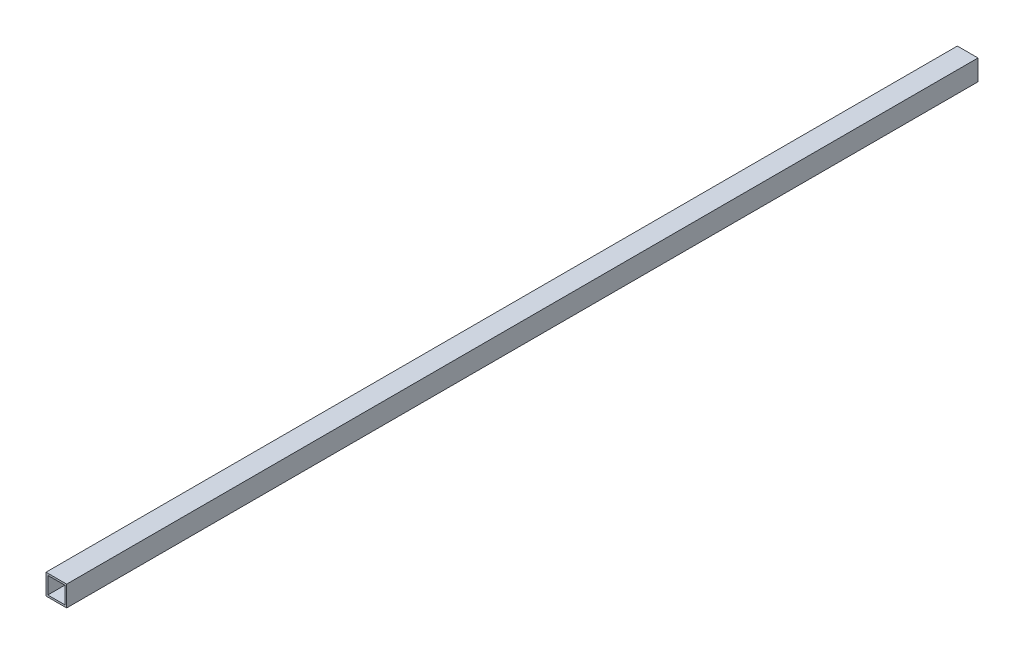
ISO-10303-21;
HEADER;
FILE_DESCRIPTION(('STEP AP214'),'2;1');
FILE_NAME('part.step','',(''),(''),'','','');
FILE_SCHEMA(('AUTOMOTIVE_DESIGN { 1 0 10303 214 1 1 1 1 }'));
ENDSEC;
DATA;
#1=APPLICATION_CONTEXT('core data for automotive mechanical design processes');
#2=APPLICATION_PROTOCOL_DEFINITION('international standard','automotive_design',2000,#1);
#3=PRODUCT_CONTEXT('',#1,'mechanical');
#4=PRODUCT('Part','Part','',(#3));
#5=PRODUCT_RELATED_PRODUCT_CATEGORY('part','',(#4));
#6=PRODUCT_DEFINITION_FORMATION('','',#4);
#7=PRODUCT_DEFINITION_CONTEXT('part definition',#1,'design');
#8=PRODUCT_DEFINITION('design','',#6,#7);
#9=PRODUCT_DEFINITION_SHAPE('','',#8);
#10=(LENGTH_UNIT() NAMED_UNIT(*) SI_UNIT(.MILLI.,.METRE.));
#11=(NAMED_UNIT(*) PLANE_ANGLE_UNIT() SI_UNIT($,.RADIAN.));
#12=(NAMED_UNIT(*) SI_UNIT($,.STERADIAN.) SOLID_ANGLE_UNIT());
#13=UNCERTAINTY_MEASURE_WITH_UNIT(LENGTH_MEASURE(1.E-05),#10,'distance_accuracy_value','');
#14=(GEOMETRIC_REPRESENTATION_CONTEXT(3) GLOBAL_UNCERTAINTY_ASSIGNED_CONTEXT((#13)) GLOBAL_UNIT_ASSIGNED_CONTEXT((#10,
#11,#12)) REPRESENTATION_CONTEXT('',''));
#15=CARTESIAN_POINT('',(0.,0.,0.));
#16=DIRECTION('',(0.,0.,1.));
#17=DIRECTION('',(1.,0.,0.));
#18=AXIS2_PLACEMENT_3D('',#15,#16,#17);
#19=CARTESIAN_POINT('',(0.,0.,750.));
#20=DIRECTION('',(0.,0.,1.));
#21=DIRECTION('',(1.,0.,0.));
#22=AXIS2_PLACEMENT_3D('',#19,#20,#21);
#23=PLANE('',#22);
#24=DIRECTION('',(0.,1.,0.));
#25=VECTOR('',#24,1.);
#26=CARTESIAN_POINT('',(8.5,8.5,750.));
#27=LINE('',#26,#25);
#28=CARTESIAN_POINT('',(8.5,-8.5,750.));
#29=VERTEX_POINT('',#28);
#30=CARTESIAN_POINT('',(8.5,8.5,750.));
#31=VERTEX_POINT('',#30);
#32=EDGE_CURVE('E137',#29,#31,#27,.T.);
#33=ORIENTED_EDGE('',*,*,#32,.T.);
#34=DIRECTION('',(-1.,0.,0.));
#35=VECTOR('',#34,1.);
#36=CARTESIAN_POINT('',(-8.5,8.5,750.));
#37=LINE('',#36,#35);
#38=CARTESIAN_POINT('',(-8.5,8.5,750.));
#39=VERTEX_POINT('',#38);
#40=EDGE_CURVE('E140',#31,#39,#37,.T.);
#41=ORIENTED_EDGE('',*,*,#40,.T.);
#42=DIRECTION('',(0.,-1.,0.));
#43=VECTOR('',#42,1.);
#44=CARTESIAN_POINT('',(-8.5,8.5,750.));
#45=LINE('',#44,#43);
#46=CARTESIAN_POINT('',(-8.5,-8.5,750.));
#47=VERTEX_POINT('',#46);
#48=EDGE_CURVE('E143',#39,#47,#45,.T.);
#49=ORIENTED_EDGE('',*,*,#48,.T.);
#50=DIRECTION('',(1.,0.,0.));
#51=VECTOR('',#50,1.);
#52=CARTESIAN_POINT('',(-8.5,-8.5,750.));
#53=LINE('',#52,#51);
#54=EDGE_CURVE('E145',#47,#29,#53,.T.);
#55=ORIENTED_EDGE('',*,*,#54,.T.);
#56=EDGE_LOOP('',(#33,#41,#49,#55));
#57=FACE_BOUND('',#56,.T.);
#58=DIRECTION('',(-1.,0.,0.));
#59=VECTOR('',#58,1.);
#60=CARTESIAN_POINT('',(-7.,7.,750.));
#61=LINE('',#60,#59);
#62=CARTESIAN_POINT('',(7.,7.,750.));
#63=VERTEX_POINT('',#62);
#64=CARTESIAN_POINT('',(-7.,7.,750.));
#65=VERTEX_POINT('',#64);
#66=EDGE_CURVE('E109',#63,#65,#61,.T.);
#67=ORIENTED_EDGE('',*,*,#66,.F.);
#68=DIRECTION('',(0.,1.,0.));
#69=VECTOR('',#68,1.);
#70=CARTESIAN_POINT('',(7.,7.,750.));
#71=LINE('',#70,#69);
#72=CARTESIAN_POINT('',(7.,-7.,750.));
#73=VERTEX_POINT('',#72);
#74=EDGE_CURVE('E101',#73,#63,#71,.T.);
#75=ORIENTED_EDGE('',*,*,#74,.F.);
#76=DIRECTION('',(1.,0.,0.));
#77=VECTOR('',#76,1.);
#78=CARTESIAN_POINT('',(-7.,-7.,750.));
#79=LINE('',#78,#77);
#80=CARTESIAN_POINT('',(-7.,-7.,750.));
#81=VERTEX_POINT('',#80);
#82=EDGE_CURVE('E123',#81,#73,#79,.T.);
#83=ORIENTED_EDGE('',*,*,#82,.F.);
#84=DIRECTION('',(0.,-1.,0.));
#85=VECTOR('',#84,1.);
#86=CARTESIAN_POINT('',(-7.,7.,750.));
#87=LINE('',#86,#85);
#88=EDGE_CURVE('E121',#65,#81,#87,.T.);
#89=ORIENTED_EDGE('',*,*,#88,.F.);
#90=EDGE_LOOP('',(#67,#75,#83,#89));
#91=FACE_BOUND('',#90,.T.);
#92=ADVANCED_FACE('F36',(#57,#91),#23,.T.);
#93=CARTESIAN_POINT('',(0.,0.,0.));
#94=DIRECTION('',(0.,0.,1.));
#95=DIRECTION('',(1.,0.,0.));
#96=AXIS2_PLACEMENT_3D('',#93,#94,#95);
#97=PLANE('',#96);
#98=DIRECTION('',(0.,1.,0.));
#99=VECTOR('',#98,1.);
#100=CARTESIAN_POINT('',(8.5,8.5,0.));
#101=LINE('',#100,#99);
#102=CARTESIAN_POINT('',(8.5,-8.5,0.));
#103=VERTEX_POINT('',#102);
#104=CARTESIAN_POINT('',(8.5,8.5,0.));
#105=VERTEX_POINT('',#104);
#106=EDGE_CURVE('E117',#103,#105,#101,.T.);
#107=ORIENTED_EDGE('',*,*,#106,.F.);
#108=DIRECTION('',(1.,0.,0.));
#109=VECTOR('',#108,1.);
#110=CARTESIAN_POINT('',(-8.5,-8.5,0.));
#111=LINE('',#110,#109);
#112=CARTESIAN_POINT('',(-8.5,-8.5,0.));
#113=VERTEX_POINT('',#112);
#114=EDGE_CURVE('E141',#113,#103,#111,.T.);
#115=ORIENTED_EDGE('',*,*,#114,.F.);
#116=DIRECTION('',(0.,-1.,0.));
#117=VECTOR('',#116,1.);
#118=CARTESIAN_POINT('',(-8.5,8.5,0.));
#119=LINE('',#118,#117);
#120=CARTESIAN_POINT('',(-8.5,8.5,0.));
#121=VERTEX_POINT('',#120);
#122=EDGE_CURVE('E152',#121,#113,#119,.T.);
#123=ORIENTED_EDGE('',*,*,#122,.F.);
#124=DIRECTION('',(-1.,0.,0.));
#125=VECTOR('',#124,1.);
#126=CARTESIAN_POINT('',(-8.5,8.5,0.));
#127=LINE('',#126,#125);
#128=EDGE_CURVE('E150',#105,#121,#127,.T.);
#129=ORIENTED_EDGE('',*,*,#128,.F.);
#130=EDGE_LOOP('',(#107,#115,#123,#129));
#131=FACE_BOUND('',#130,.T.);
#132=DIRECTION('',(0.,1.,0.));
#133=VECTOR('',#132,1.);
#134=CARTESIAN_POINT('',(7.,7.,0.));
#135=LINE('',#134,#133);
#136=CARTESIAN_POINT('',(7.,-7.,0.));
#137=VERTEX_POINT('',#136);
#138=CARTESIAN_POINT('',(7.,7.,0.));
#139=VERTEX_POINT('',#138);
#140=EDGE_CURVE('E59',#137,#139,#135,.T.);
#141=ORIENTED_EDGE('',*,*,#140,.T.);
#142=DIRECTION('',(-1.,0.,0.));
#143=VECTOR('',#142,1.);
#144=CARTESIAN_POINT('',(-7.,7.,0.));
#145=LINE('',#144,#143);
#146=CARTESIAN_POINT('',(-7.,7.,0.));
#147=VERTEX_POINT('',#146);
#148=EDGE_CURVE('E116',#139,#147,#145,.T.);
#149=ORIENTED_EDGE('',*,*,#148,.T.);
#150=DIRECTION('',(0.,-1.,0.));
#151=VECTOR('',#150,1.);
#152=CARTESIAN_POINT('',(-7.,7.,0.));
#153=LINE('',#152,#151);
#154=CARTESIAN_POINT('',(-7.,-7.,0.));
#155=VERTEX_POINT('',#154);
#156=EDGE_CURVE('E129',#147,#155,#153,.T.);
#157=ORIENTED_EDGE('',*,*,#156,.T.);
#158=DIRECTION('',(1.,0.,0.));
#159=VECTOR('',#158,1.);
#160=CARTESIAN_POINT('',(-7.,-7.,0.));
#161=LINE('',#160,#159);
#162=EDGE_CURVE('E110',#155,#137,#161,.T.);
#163=ORIENTED_EDGE('',*,*,#162,.T.);
#164=EDGE_LOOP('',(#141,#149,#157,#163));
#165=FACE_BOUND('',#164,.T.);
#166=ADVANCED_FACE('F170',(#131,#165),#97,.F.);
#167=CARTESIAN_POINT('',(8.5,8.5,750.));
#168=DIRECTION('',(-1.,0.,0.));
#169=DIRECTION('',(0.,-1.,0.));
#170=AXIS2_PLACEMENT_3D('',#167,#168,#169);
#171=PLANE('',#170);
#172=ORIENTED_EDGE('',*,*,#106,.T.);
#173=DIRECTION('',(0.,0.,-1.));
#174=VECTOR('',#173,1.);
#175=CARTESIAN_POINT('',(8.5,8.5,750.));
#176=LINE('',#175,#174);
#177=EDGE_CURVE('E11',#31,#105,#176,.T.);
#178=ORIENTED_EDGE('',*,*,#177,.F.);
#179=ORIENTED_EDGE('',*,*,#32,.F.);
#180=DIRECTION('',(0.,0.,-1.));
#181=VECTOR('',#180,1.);
#182=CARTESIAN_POINT('',(8.5,-8.5,750.));
#183=LINE('',#182,#181);
#184=EDGE_CURVE('E147',#29,#103,#183,.T.);
#185=ORIENTED_EDGE('',*,*,#184,.T.);
#186=EDGE_LOOP('',(#172,#178,#179,#185));
#187=FACE_BOUND('',#186,.T.);
#188=ADVANCED_FACE('F38',(#187),#171,.F.);
#189=CARTESIAN_POINT('',(-8.5,8.5,750.));
#190=DIRECTION('',(0.,-1.,0.));
#191=DIRECTION('',(0.,0.,-1.));
#192=AXIS2_PLACEMENT_3D('',#189,#190,#191);
#193=PLANE('',#192);
#194=ORIENTED_EDGE('',*,*,#128,.T.);
#195=DIRECTION('',(0.,0.,-1.));
#196=VECTOR('',#195,1.);
#197=CARTESIAN_POINT('',(-8.5,8.5,750.));
#198=LINE('',#197,#196);
#199=EDGE_CURVE('E44',#39,#121,#198,.T.);
#200=ORIENTED_EDGE('',*,*,#199,.F.);
#201=ORIENTED_EDGE('',*,*,#40,.F.);
#202=ORIENTED_EDGE('',*,*,#177,.T.);
#203=EDGE_LOOP('',(#194,#200,#201,#202));
#204=FACE_BOUND('',#203,.T.);
#205=ADVANCED_FACE('F180',(#204),#193,.F.);
#206=CARTESIAN_POINT('',(-8.5,8.5,750.));
#207=DIRECTION('',(1.,0.,0.));
#208=DIRECTION('',(0.,1.,0.));
#209=AXIS2_PLACEMENT_3D('',#206,#207,#208);
#210=PLANE('',#209);
#211=ORIENTED_EDGE('',*,*,#122,.T.);
#212=DIRECTION('',(0.,0.,-1.));
#213=VECTOR('',#212,1.);
#214=CARTESIAN_POINT('',(-8.5,-8.5,750.));
#215=LINE('',#214,#213);
#216=EDGE_CURVE('E157',#47,#113,#215,.T.);
#217=ORIENTED_EDGE('',*,*,#216,.F.);
#218=ORIENTED_EDGE('',*,*,#48,.F.);
#219=ORIENTED_EDGE('',*,*,#199,.T.);
#220=EDGE_LOOP('',(#211,#217,#218,#219));
#221=FACE_BOUND('',#220,.T.);
#222=ADVANCED_FACE('F164',(#221),#210,.F.);
#223=CARTESIAN_POINT('',(-8.5,-8.5,750.));
#224=DIRECTION('',(0.,1.,0.));
#225=DIRECTION('',(0.,0.,1.));
#226=AXIS2_PLACEMENT_3D('',#223,#224,#225);
#227=PLANE('',#226);
#228=ORIENTED_EDGE('',*,*,#114,.T.);
#229=ORIENTED_EDGE('',*,*,#184,.F.);
#230=ORIENTED_EDGE('',*,*,#54,.F.);
#231=ORIENTED_EDGE('',*,*,#216,.T.);
#232=EDGE_LOOP('',(#228,#229,#230,#231));
#233=FACE_BOUND('',#232,.T.);
#234=ADVANCED_FACE('F174',(#233),#227,.F.);
#235=CARTESIAN_POINT('',(7.,7.,750.));
#236=DIRECTION('',(-1.,0.,0.));
#237=DIRECTION('',(0.,0.,1.));
#238=AXIS2_PLACEMENT_3D('',#235,#236,#237);
#239=PLANE('',#238);
#240=ORIENTED_EDGE('',*,*,#140,.F.);
#241=DIRECTION('',(0.,0.,-1.));
#242=VECTOR('',#241,1.);
#243=CARTESIAN_POINT('',(7.,-7.,750.));
#244=LINE('',#243,#242);
#245=EDGE_CURVE('E105',#73,#137,#244,.T.);
#246=ORIENTED_EDGE('',*,*,#245,.F.);
#247=ORIENTED_EDGE('',*,*,#74,.T.);
#248=DIRECTION('',(0.,0.,-1.));
#249=VECTOR('',#248,1.);
#250=CARTESIAN_POINT('',(7.,7.,750.));
#251=LINE('',#250,#249);
#252=EDGE_CURVE('E104',#63,#139,#251,.T.);
#253=ORIENTED_EDGE('',*,*,#252,.T.);
#254=EDGE_LOOP('',(#240,#246,#247,#253));
#255=FACE_BOUND('',#254,.T.);
#256=ADVANCED_FACE('F103',(#255),#239,.T.);
#257=CARTESIAN_POINT('',(-7.,7.,750.));
#258=DIRECTION('',(0.,-1.,0.));
#259=DIRECTION('',(0.,0.,-1.));
#260=AXIS2_PLACEMENT_3D('',#257,#258,#259);
#261=PLANE('',#260);
#262=ORIENTED_EDGE('',*,*,#148,.F.);
#263=ORIENTED_EDGE('',*,*,#252,.F.);
#264=ORIENTED_EDGE('',*,*,#66,.T.);
#265=DIRECTION('',(0.,0.,-1.));
#266=VECTOR('',#265,1.);
#267=CARTESIAN_POINT('',(-7.,7.,750.));
#268=LINE('',#267,#266);
#269=EDGE_CURVE('E118',#65,#147,#268,.T.);
#270=ORIENTED_EDGE('',*,*,#269,.T.);
#271=EDGE_LOOP('',(#262,#263,#264,#270));
#272=FACE_BOUND('',#271,.T.);
#273=ADVANCED_FACE('F113',(#272),#261,.T.);
#274=CARTESIAN_POINT('',(-7.,7.,750.));
#275=DIRECTION('',(1.,0.,0.));
#276=DIRECTION('',(0.,0.,-1.));
#277=AXIS2_PLACEMENT_3D('',#274,#275,#276);
#278=PLANE('',#277);
#279=ORIENTED_EDGE('',*,*,#156,.F.);
#280=ORIENTED_EDGE('',*,*,#269,.F.);
#281=ORIENTED_EDGE('',*,*,#88,.T.);
#282=DIRECTION('',(0.,0.,-1.));
#283=VECTOR('',#282,1.);
#284=CARTESIAN_POINT('',(-7.,-7.,750.));
#285=LINE('',#284,#283);
#286=EDGE_CURVE('E51',#81,#155,#285,.T.);
#287=ORIENTED_EDGE('',*,*,#286,.T.);
#288=EDGE_LOOP('',(#279,#280,#281,#287));
#289=FACE_BOUND('',#288,.T.);
#290=ADVANCED_FACE('F203',(#289),#278,.T.);
#291=CARTESIAN_POINT('',(-7.,-7.,750.));
#292=DIRECTION('',(0.,1.,0.));
#293=DIRECTION('',(0.,0.,1.));
#294=AXIS2_PLACEMENT_3D('',#291,#292,#293);
#295=PLANE('',#294);
#296=ORIENTED_EDGE('',*,*,#162,.F.);
#297=ORIENTED_EDGE('',*,*,#286,.F.);
#298=ORIENTED_EDGE('',*,*,#82,.T.);
#299=ORIENTED_EDGE('',*,*,#245,.T.);
#300=EDGE_LOOP('',(#296,#297,#298,#299));
#301=FACE_BOUND('',#300,.T.);
#302=ADVANCED_FACE('F207',(#301),#295,.T.);
#303=CLOSED_SHELL('',(#92,#166,#188,#205,#222,#234,#256,#273,#290,#302));
#304=MANIFOLD_SOLID_BREP('B2',#303);
#305=ADVANCED_BREP_SHAPE_REPRESENTATION('',(#18,#304),#14);
#306=SHAPE_DEFINITION_REPRESENTATION(#9,#305);
ENDSEC;
END-ISO-10303-21;
